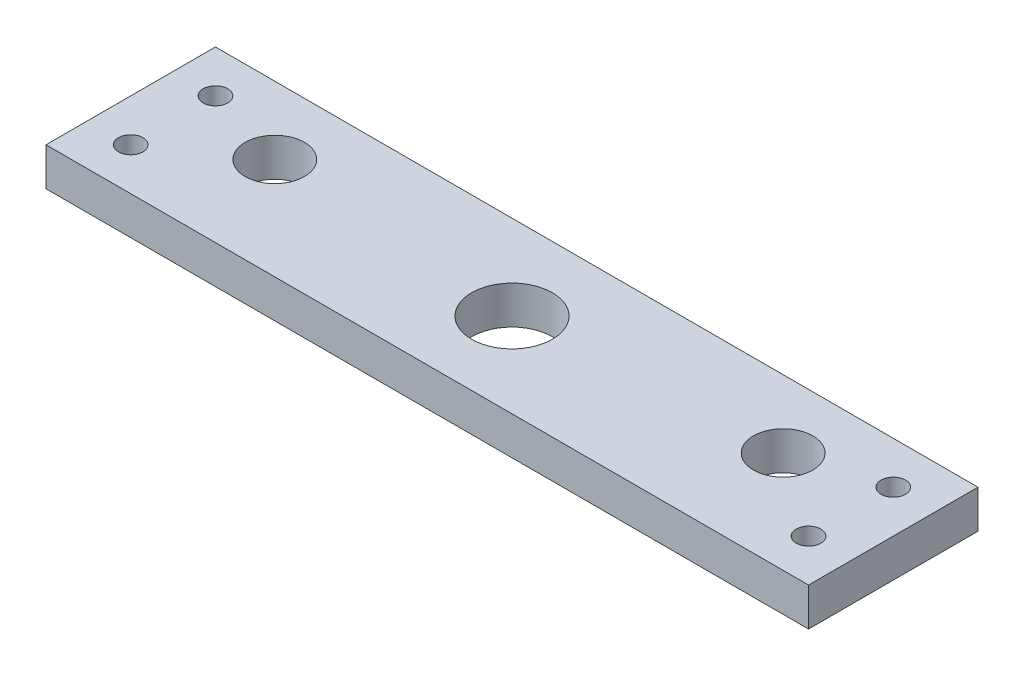
ISO-10303-21;
HEADER;
FILE_DESCRIPTION(('STEP AP214'),'2;1');
FILE_NAME('part.step','',(''),(''),'','','');
FILE_SCHEMA(('AUTOMOTIVE_DESIGN { 1 0 10303 214 1 1 1 1 }'));
ENDSEC;
DATA;
#1=APPLICATION_CONTEXT('core data for automotive mechanical design processes');
#2=APPLICATION_PROTOCOL_DEFINITION('international standard','automotive_design',2000,#1);
#3=PRODUCT_CONTEXT('',#1,'mechanical');
#4=PRODUCT('Part','Part','',(#3));
#5=PRODUCT_RELATED_PRODUCT_CATEGORY('part','',(#4));
#6=PRODUCT_DEFINITION_FORMATION('','',#4);
#7=PRODUCT_DEFINITION_CONTEXT('part definition',#1,'design');
#8=PRODUCT_DEFINITION('design','',#6,#7);
#9=PRODUCT_DEFINITION_SHAPE('','',#8);
#10=(LENGTH_UNIT() NAMED_UNIT(*) SI_UNIT(.MILLI.,.METRE.));
#11=(NAMED_UNIT(*) PLANE_ANGLE_UNIT() SI_UNIT($,.RADIAN.));
#12=(NAMED_UNIT(*) SI_UNIT($,.STERADIAN.) SOLID_ANGLE_UNIT());
#13=UNCERTAINTY_MEASURE_WITH_UNIT(LENGTH_MEASURE(1.E-05),#10,'distance_accuracy_value','');
#14=(GEOMETRIC_REPRESENTATION_CONTEXT(3) GLOBAL_UNCERTAINTY_ASSIGNED_CONTEXT((#13)) GLOBAL_UNIT_ASSIGNED_CONTEXT((#10,
#11,#12)) REPRESENTATION_CONTEXT('',''));
#15=CARTESIAN_POINT('',(0.,0.,0.));
#16=DIRECTION('',(0.,0.,1.));
#17=DIRECTION('',(1.,0.,0.));
#18=AXIS2_PLACEMENT_3D('',#15,#16,#17);
#19=CARTESIAN_POINT('',(0.,4.5,0.));
#20=DIRECTION('',(0.,1.,0.));
#21=DIRECTION('',(0.,0.,1.));
#22=AXIS2_PLACEMENT_3D('',#19,#20,#21);
#23=PLANE('',#22);
#24=CARTESIAN_POINT('',(30.,4.5,-2.00000000000001));
#25=DIRECTION('',(0.,1.,0.));
#26=DIRECTION('',(0.,0.,1.));
#27=AXIS2_PLACEMENT_3D('',#24,#25,#26);
#28=CIRCLE('',#27,3.5);
#29=CARTESIAN_POINT('',(30.,4.5,1.49999999999999));
#30=VERTEX_POINT('',#29);
#31=EDGE_CURVE('E162',#30,#30,#28,.T.);
#32=ORIENTED_EDGE('',*,*,#31,.F.);
#33=EDGE_LOOP('',(#32));
#34=FACE_BOUND('',#33,.T.);
#35=CARTESIAN_POINT('',(-30.,4.5,-2.));
#36=DIRECTION('',(0.,1.,0.));
#37=DIRECTION('',(0.,0.,1.));
#38=AXIS2_PLACEMENT_3D('',#35,#36,#37);
#39=CIRCLE('',#38,3.5);
#40=CARTESIAN_POINT('',(-30.,4.5,1.5));
#41=VERTEX_POINT('',#40);
#42=EDGE_CURVE('E156',#41,#41,#39,.T.);
#43=ORIENTED_EDGE('',*,*,#42,.F.);
#44=EDGE_LOOP('',(#43));
#45=FACE_BOUND('',#44,.T.);
#46=CARTESIAN_POINT('',(0.,4.5,0.));
#47=DIRECTION('',(0.,-1.,0.));
#48=DIRECTION('',(0.,0.,1.));
#49=AXIS2_PLACEMENT_3D('',#46,#47,#48);
#50=CIRCLE('',#49,4.7625);
#51=CARTESIAN_POINT('',(0.,4.5,4.7625));
#52=VERTEX_POINT('',#51);
#53=EDGE_CURVE('E118',#52,#52,#50,.T.);
#54=ORIENTED_EDGE('',*,*,#53,.T.);
#55=EDGE_LOOP('',(#54));
#56=FACE_BOUND('',#55,.T.);
#57=CARTESIAN_POINT('',(-40.,4.5,-5.));
#58=DIRECTION('',(0.,1.,0.));
#59=DIRECTION('',(0.,0.,1.));
#60=AXIS2_PLACEMENT_3D('',#57,#58,#59);
#61=CIRCLE('',#60,1.45);
#62=CARTESIAN_POINT('',(-40.,4.5,-3.55));
#63=VERTEX_POINT('',#62);
#64=EDGE_CURVE('E110',#63,#63,#61,.T.);
#65=ORIENTED_EDGE('',*,*,#64,.F.);
#66=EDGE_LOOP('',(#65));
#67=FACE_BOUND('',#66,.T.);
#68=DIRECTION('',(0.,0.,1.));
#69=VECTOR('',#68,1.);
#70=CARTESIAN_POINT('',(-45.,4.5,10.));
#71=LINE('',#70,#69);
#72=CARTESIAN_POINT('',(-45.,4.5,-10.));
#73=VERTEX_POINT('',#72);
#74=CARTESIAN_POINT('',(-45.,4.5,10.));
#75=VERTEX_POINT('',#74);
#76=EDGE_CURVE('E115',#73,#75,#71,.T.);
#77=ORIENTED_EDGE('',*,*,#76,.T.);
#78=DIRECTION('',(1.,0.,0.));
#79=VECTOR('',#78,1.);
#80=CARTESIAN_POINT('',(-45.,4.5,10.));
#81=LINE('',#80,#79);
#82=CARTESIAN_POINT('',(45.,4.5,10.));
#83=VERTEX_POINT('',#82);
#84=EDGE_CURVE('E65',#75,#83,#81,.T.);
#85=ORIENTED_EDGE('',*,*,#84,.T.);
#86=DIRECTION('',(0.,0.,1.));
#87=VECTOR('',#86,1.);
#88=CARTESIAN_POINT('',(45.,4.5,10.));
#89=LINE('',#88,#87);
#90=CARTESIAN_POINT('',(45.,4.5,-10.));
#91=VERTEX_POINT('',#90);
#92=EDGE_CURVE('E87',#91,#83,#89,.T.);
#93=ORIENTED_EDGE('',*,*,#92,.F.);
#94=DIRECTION('',(-1.,0.,0.));
#95=VECTOR('',#94,1.);
#96=CARTESIAN_POINT('',(-45.,4.5,-10.));
#97=LINE('',#96,#95);
#98=EDGE_CURVE('E48',#91,#73,#97,.T.);
#99=ORIENTED_EDGE('',*,*,#98,.T.);
#100=EDGE_LOOP('',(#77,#85,#93,#99));
#101=FACE_BOUND('',#100,.T.);
#102=CARTESIAN_POINT('',(-40.,4.5,5.));
#103=DIRECTION('',(0.,1.,0.));
#104=DIRECTION('',(0.,0.,1.));
#105=AXIS2_PLACEMENT_3D('',#102,#103,#104);
#106=CIRCLE('',#105,1.45);
#107=CARTESIAN_POINT('',(-40.,4.5,6.45));
#108=VERTEX_POINT('',#107);
#109=EDGE_CURVE('E104',#108,#108,#106,.T.);
#110=ORIENTED_EDGE('',*,*,#109,.F.);
#111=EDGE_LOOP('',(#110));
#112=FACE_BOUND('',#111,.T.);
#113=CARTESIAN_POINT('',(40.,4.5,5.));
#114=DIRECTION('',(0.,-1.,0.));
#115=DIRECTION('',(0.,0.,1.));
#116=AXIS2_PLACEMENT_3D('',#113,#114,#115);
#117=CIRCLE('',#116,1.45);
#118=CARTESIAN_POINT('',(40.,4.5,6.45));
#119=VERTEX_POINT('',#118);
#120=EDGE_CURVE('E139',#119,#119,#117,.T.);
#121=ORIENTED_EDGE('',*,*,#120,.T.);
#122=EDGE_LOOP('',(#121));
#123=FACE_BOUND('',#122,.T.);
#124=CARTESIAN_POINT('',(40.,4.5,-5.));
#125=DIRECTION('',(0.,-1.,0.));
#126=DIRECTION('',(0.,0.,1.));
#127=AXIS2_PLACEMENT_3D('',#124,#125,#126);
#128=CIRCLE('',#127,1.45);
#129=CARTESIAN_POINT('',(40.,4.5,-3.55));
#130=VERTEX_POINT('',#129);
#131=EDGE_CURVE('E94',#130,#130,#128,.T.);
#132=ORIENTED_EDGE('',*,*,#131,.T.);
#133=EDGE_LOOP('',(#132));
#134=FACE_BOUND('',#133,.T.);
#135=ADVANCED_FACE('F31',(#34,#45,#56,#67,#101,#112,#123,#134),#23,.T.);
#136=CARTESIAN_POINT('',(0.,0.,0.));
#137=DIRECTION('',(0.,1.,0.));
#138=DIRECTION('',(0.,0.,1.));
#139=AXIS2_PLACEMENT_3D('',#136,#137,#138);
#140=PLANE('',#139);
#141=CARTESIAN_POINT('',(30.,0.,-2.00000000000001));
#142=DIRECTION('',(0.,1.,0.));
#143=DIRECTION('',(0.,0.,1.));
#144=AXIS2_PLACEMENT_3D('',#141,#142,#143);
#145=CIRCLE('',#144,3.5);
#146=CARTESIAN_POINT('',(30.,0.,1.49999999999999));
#147=VERTEX_POINT('',#146);
#148=EDGE_CURVE('E159',#147,#147,#145,.T.);
#149=ORIENTED_EDGE('',*,*,#148,.T.);
#150=EDGE_LOOP('',(#149));
#151=FACE_BOUND('',#150,.T.);
#152=CARTESIAN_POINT('',(-30.,0.,-2.));
#153=DIRECTION('',(0.,1.,0.));
#154=DIRECTION('',(0.,0.,1.));
#155=AXIS2_PLACEMENT_3D('',#152,#153,#154);
#156=CIRCLE('',#155,3.5);
#157=CARTESIAN_POINT('',(-30.,0.,1.5));
#158=VERTEX_POINT('',#157);
#159=EDGE_CURVE('E154',#158,#158,#156,.T.);
#160=ORIENTED_EDGE('',*,*,#159,.T.);
#161=EDGE_LOOP('',(#160));
#162=FACE_BOUND('',#161,.T.);
#163=CARTESIAN_POINT('',(0.,0.,0.));
#164=DIRECTION('',(0.,-1.,0.));
#165=DIRECTION('',(0.,0.,1.));
#166=AXIS2_PLACEMENT_3D('',#163,#164,#165);
#167=CIRCLE('',#166,4.7625);
#168=CARTESIAN_POINT('',(0.,0.,4.7625));
#169=VERTEX_POINT('',#168);
#170=EDGE_CURVE('E79',#169,#169,#167,.T.);
#171=ORIENTED_EDGE('',*,*,#170,.F.);
#172=EDGE_LOOP('',(#171));
#173=FACE_BOUND('',#172,.T.);
#174=CARTESIAN_POINT('',(-40.,0.,-5.));
#175=DIRECTION('',(0.,1.,0.));
#176=DIRECTION('',(0.,0.,1.));
#177=AXIS2_PLACEMENT_3D('',#174,#175,#176);
#178=CIRCLE('',#177,1.45);
#179=CARTESIAN_POINT('',(-40.,0.,-3.55));
#180=VERTEX_POINT('',#179);
#181=EDGE_CURVE('E107',#180,#180,#178,.T.);
#182=ORIENTED_EDGE('',*,*,#181,.T.);
#183=EDGE_LOOP('',(#182));
#184=FACE_BOUND('',#183,.T.);
#185=DIRECTION('',(0.,0.,1.));
#186=VECTOR('',#185,1.);
#187=CARTESIAN_POINT('',(-45.,0.,10.));
#188=LINE('',#187,#186);
#189=CARTESIAN_POINT('',(-45.,0.,-10.));
#190=VERTEX_POINT('',#189);
#191=CARTESIAN_POINT('',(-45.,0.,10.));
#192=VERTEX_POINT('',#191);
#193=EDGE_CURVE('E80',#190,#192,#188,.T.);
#194=ORIENTED_EDGE('',*,*,#193,.F.);
#195=DIRECTION('',(-1.,0.,0.));
#196=VECTOR('',#195,1.);
#197=CARTESIAN_POINT('',(-45.,0.,-10.));
#198=LINE('',#197,#196);
#199=CARTESIAN_POINT('',(45.,0.,-10.));
#200=VERTEX_POINT('',#199);
#201=EDGE_CURVE('E92',#200,#190,#198,.T.);
#202=ORIENTED_EDGE('',*,*,#201,.F.);
#203=DIRECTION('',(0.,0.,1.));
#204=VECTOR('',#203,1.);
#205=CARTESIAN_POINT('',(45.,0.,10.));
#206=LINE('',#205,#204);
#207=CARTESIAN_POINT('',(45.,0.,10.));
#208=VERTEX_POINT('',#207);
#209=EDGE_CURVE('E86',#200,#208,#206,.T.);
#210=ORIENTED_EDGE('',*,*,#209,.T.);
#211=DIRECTION('',(1.,0.,0.));
#212=VECTOR('',#211,1.);
#213=CARTESIAN_POINT('',(-45.,0.,10.));
#214=LINE('',#213,#212);
#215=EDGE_CURVE('E60',#192,#208,#214,.T.);
#216=ORIENTED_EDGE('',*,*,#215,.F.);
#217=EDGE_LOOP('',(#194,#202,#210,#216));
#218=FACE_BOUND('',#217,.T.);
#219=CARTESIAN_POINT('',(-40.,0.,5.));
#220=DIRECTION('',(0.,1.,0.));
#221=DIRECTION('',(0.,0.,1.));
#222=AXIS2_PLACEMENT_3D('',#219,#220,#221);
#223=CIRCLE('',#222,1.45);
#224=CARTESIAN_POINT('',(-40.,0.,6.45));
#225=VERTEX_POINT('',#224);
#226=EDGE_CURVE('E103',#225,#225,#223,.T.);
#227=ORIENTED_EDGE('',*,*,#226,.T.);
#228=EDGE_LOOP('',(#227));
#229=FACE_BOUND('',#228,.T.);
#230=CARTESIAN_POINT('',(40.,0.,5.));
#231=DIRECTION('',(0.,-1.,0.));
#232=DIRECTION('',(0.,0.,1.));
#233=AXIS2_PLACEMENT_3D('',#230,#231,#232);
#234=CIRCLE('',#233,1.45);
#235=CARTESIAN_POINT('',(40.,0.,6.45));
#236=VERTEX_POINT('',#235);
#237=EDGE_CURVE('E150',#236,#236,#234,.T.);
#238=ORIENTED_EDGE('',*,*,#237,.F.);
#239=EDGE_LOOP('',(#238));
#240=FACE_BOUND('',#239,.T.);
#241=CARTESIAN_POINT('',(40.,0.,-5.));
#242=DIRECTION('',(0.,-1.,0.));
#243=DIRECTION('',(0.,0.,1.));
#244=AXIS2_PLACEMENT_3D('',#241,#242,#243);
#245=CIRCLE('',#244,1.45);
#246=CARTESIAN_POINT('',(40.,0.,-3.55));
#247=VERTEX_POINT('',#246);
#248=EDGE_CURVE('E98',#247,#247,#245,.T.);
#249=ORIENTED_EDGE('',*,*,#248,.F.);
#250=EDGE_LOOP('',(#249));
#251=FACE_BOUND('',#250,.T.);
#252=ADVANCED_FACE('F90',(#151,#162,#173,#184,#218,#229,#240,#251),#140,.F.);
#253=CARTESIAN_POINT('',(-45.,4.5,10.));
#254=DIRECTION('',(1.,0.,0.));
#255=DIRECTION('',(0.,0.,-1.));
#256=AXIS2_PLACEMENT_3D('',#253,#254,#255);
#257=PLANE('',#256);
#258=ORIENTED_EDGE('',*,*,#193,.T.);
#259=DIRECTION('',(0.,-1.,0.));
#260=VECTOR('',#259,1.);
#261=CARTESIAN_POINT('',(-45.,4.5,10.));
#262=LINE('',#261,#260);
#263=EDGE_CURVE('E11',#75,#192,#262,.T.);
#264=ORIENTED_EDGE('',*,*,#263,.F.);
#265=ORIENTED_EDGE('',*,*,#76,.F.);
#266=DIRECTION('',(0.,-1.,0.));
#267=VECTOR('',#266,1.);
#268=CARTESIAN_POINT('',(-45.,4.5,-10.));
#269=LINE('',#268,#267);
#270=EDGE_CURVE('E40',#73,#190,#269,.T.);
#271=ORIENTED_EDGE('',*,*,#270,.T.);
#272=EDGE_LOOP('',(#258,#264,#265,#271));
#273=FACE_BOUND('',#272,.T.);
#274=ADVANCED_FACE('F33',(#273),#257,.F.);
#275=CARTESIAN_POINT('',(-45.,4.5,10.));
#276=DIRECTION('',(0.,0.,-1.));
#277=DIRECTION('',(-1.,0.,0.));
#278=AXIS2_PLACEMENT_3D('',#275,#276,#277);
#279=PLANE('',#278);
#280=ORIENTED_EDGE('',*,*,#215,.T.);
#281=DIRECTION('',(0.,-1.,0.));
#282=VECTOR('',#281,1.);
#283=CARTESIAN_POINT('',(45.,4.5,10.));
#284=LINE('',#283,#282);
#285=EDGE_CURVE('E75',#83,#208,#284,.T.);
#286=ORIENTED_EDGE('',*,*,#285,.F.);
#287=ORIENTED_EDGE('',*,*,#84,.F.);
#288=ORIENTED_EDGE('',*,*,#263,.T.);
#289=EDGE_LOOP('',(#280,#286,#287,#288));
#290=FACE_BOUND('',#289,.T.);
#291=ADVANCED_FACE('F74',(#290),#279,.F.);
#292=CARTESIAN_POINT('',(0.,4.5,0.));
#293=DIRECTION('',(0.,-1.,0.));
#294=DIRECTION('',(0.,0.,-1.));
#295=AXIS2_PLACEMENT_3D('',#292,#293,#294);
#296=CYLINDRICAL_SURFACE('',#295,4.7625);
#297=ORIENTED_EDGE('',*,*,#170,.T.);
#298=EDGE_LOOP('',(#297));
#299=FACE_BOUND('',#298,.T.);
#300=ORIENTED_EDGE('',*,*,#53,.F.);
#301=EDGE_LOOP('',(#300));
#302=FACE_BOUND('',#301,.T.);
#303=ADVANCED_FACE('F199',(#299,#302),#296,.F.);
#304=CARTESIAN_POINT('',(-45.,4.5,-10.));
#305=DIRECTION('',(0.,0.,1.));
#306=DIRECTION('',(1.,0.,0.));
#307=AXIS2_PLACEMENT_3D('',#304,#305,#306);
#308=PLANE('',#307);
#309=ORIENTED_EDGE('',*,*,#201,.T.);
#310=ORIENTED_EDGE('',*,*,#270,.F.);
#311=ORIENTED_EDGE('',*,*,#98,.F.);
#312=DIRECTION('',(0.,-1.,0.));
#313=VECTOR('',#312,1.);
#314=CARTESIAN_POINT('',(45.,4.5,-10.));
#315=LINE('',#314,#313);
#316=EDGE_CURVE('E88',#91,#200,#315,.T.);
#317=ORIENTED_EDGE('',*,*,#316,.T.);
#318=EDGE_LOOP('',(#309,#310,#311,#317));
#319=FACE_BOUND('',#318,.T.);
#320=ADVANCED_FACE('F129',(#319),#308,.F.);
#321=CARTESIAN_POINT('',(-40.,4.5,-5.));
#322=DIRECTION('',(0.,-1.,0.));
#323=DIRECTION('',(0.,0.,-1.));
#324=AXIS2_PLACEMENT_3D('',#321,#322,#323);
#325=CYLINDRICAL_SURFACE('',#324,1.45);
#326=ORIENTED_EDGE('',*,*,#64,.T.);
#327=EDGE_LOOP('',(#326));
#328=FACE_BOUND('',#327,.T.);
#329=ORIENTED_EDGE('',*,*,#181,.F.);
#330=EDGE_LOOP('',(#329));
#331=FACE_BOUND('',#330,.T.);
#332=ADVANCED_FACE('F183',(#328,#331),#325,.F.);
#333=CARTESIAN_POINT('',(-40.,4.5,5.));
#334=DIRECTION('',(0.,-1.,0.));
#335=DIRECTION('',(0.,0.,-1.));
#336=AXIS2_PLACEMENT_3D('',#333,#334,#335);
#337=CYLINDRICAL_SURFACE('',#336,1.45);
#338=ORIENTED_EDGE('',*,*,#109,.T.);
#339=EDGE_LOOP('',(#338));
#340=FACE_BOUND('',#339,.T.);
#341=ORIENTED_EDGE('',*,*,#226,.F.);
#342=EDGE_LOOP('',(#341));
#343=FACE_BOUND('',#342,.T.);
#344=ADVANCED_FACE('F186',(#340,#343),#337,.F.);
#345=CARTESIAN_POINT('',(45.,4.5,10.));
#346=DIRECTION('',(1.,0.,0.));
#347=DIRECTION('',(0.,0.,-1.));
#348=AXIS2_PLACEMENT_3D('',#345,#346,#347);
#349=PLANE('',#348);
#350=ORIENTED_EDGE('',*,*,#209,.F.);
#351=ORIENTED_EDGE('',*,*,#316,.F.);
#352=ORIENTED_EDGE('',*,*,#92,.T.);
#353=ORIENTED_EDGE('',*,*,#285,.T.);
#354=EDGE_LOOP('',(#350,#351,#352,#353));
#355=FACE_BOUND('',#354,.T.);
#356=ADVANCED_FACE('F84',(#355),#349,.T.);
#357=CARTESIAN_POINT('',(40.,4.5,-5.));
#358=DIRECTION('',(0.,-1.,0.));
#359=DIRECTION('',(0.,0.,-1.));
#360=AXIS2_PLACEMENT_3D('',#357,#358,#359);
#361=CYLINDRICAL_SURFACE('',#360,1.45);
#362=ORIENTED_EDGE('',*,*,#131,.F.);
#363=EDGE_LOOP('',(#362));
#364=FACE_BOUND('',#363,.T.);
#365=ORIENTED_EDGE('',*,*,#248,.T.);
#366=EDGE_LOOP('',(#365));
#367=FACE_BOUND('',#366,.T.);
#368=ADVANCED_FACE('F142',(#364,#367),#361,.F.);
#369=CARTESIAN_POINT('',(40.,4.5,5.));
#370=DIRECTION('',(0.,-1.,0.));
#371=DIRECTION('',(0.,0.,-1.));
#372=AXIS2_PLACEMENT_3D('',#369,#370,#371);
#373=CYLINDRICAL_SURFACE('',#372,1.45);
#374=ORIENTED_EDGE('',*,*,#120,.F.);
#375=EDGE_LOOP('',(#374));
#376=FACE_BOUND('',#375,.T.);
#377=ORIENTED_EDGE('',*,*,#237,.T.);
#378=EDGE_LOOP('',(#377));
#379=FACE_BOUND('',#378,.T.);
#380=ADVANCED_FACE('F145',(#376,#379),#373,.F.);
#381=CARTESIAN_POINT('',(-30.,0.,-2.));
#382=DIRECTION('',(0.,1.,0.));
#383=DIRECTION('',(0.,0.,1.));
#384=AXIS2_PLACEMENT_3D('',#381,#382,#383);
#385=CYLINDRICAL_SURFACE('',#384,3.5);
#386=ORIENTED_EDGE('',*,*,#159,.F.);
#387=EDGE_LOOP('',(#386));
#388=FACE_BOUND('',#387,.T.);
#389=ORIENTED_EDGE('',*,*,#42,.T.);
#390=EDGE_LOOP('',(#389));
#391=FACE_BOUND('',#390,.T.);
#392=ADVANCED_FACE('F173',(#388,#391),#385,.F.);
#393=CARTESIAN_POINT('',(30.,0.,-2.00000000000001));
#394=DIRECTION('',(0.,1.,0.));
#395=DIRECTION('',(0.,0.,1.));
#396=AXIS2_PLACEMENT_3D('',#393,#394,#395);
#397=CYLINDRICAL_SURFACE('',#396,3.5);
#398=ORIENTED_EDGE('',*,*,#148,.F.);
#399=EDGE_LOOP('',(#398));
#400=FACE_BOUND('',#399,.T.);
#401=ORIENTED_EDGE('',*,*,#31,.T.);
#402=EDGE_LOOP('',(#401));
#403=FACE_BOUND('',#402,.T.);
#404=ADVANCED_FACE('F170',(#400,#403),#397,.F.);
#405=CLOSED_SHELL('',(#135,#252,#274,#291,#303,#320,#332,#344,#356,#368,#380,#392,#404));
#406=MANIFOLD_SOLID_BREP('B2',#405);
#407=ADVANCED_BREP_SHAPE_REPRESENTATION('',(#18,#406),#14);
#408=SHAPE_DEFINITION_REPRESENTATION(#9,#407);
ENDSEC;
END-ISO-10303-21;
